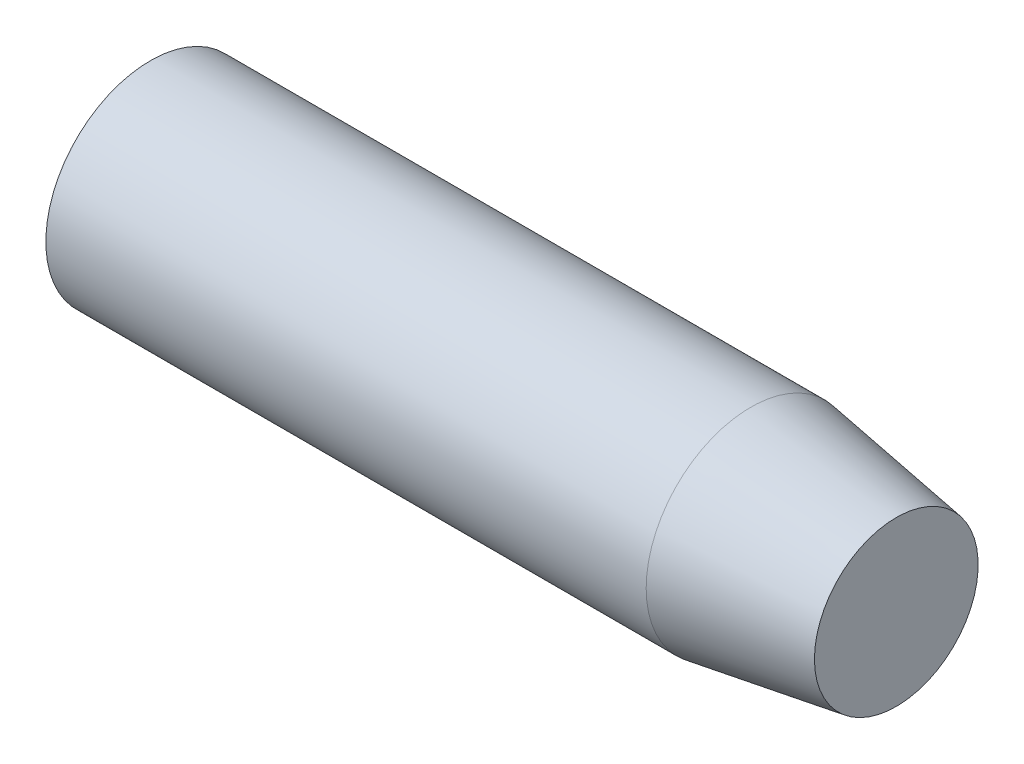
ISO-10303-21;
HEADER;
FILE_DESCRIPTION(('STEP AP214'),'2;1');
FILE_NAME('part.step','',(''),(''),'','','');
FILE_SCHEMA(('AUTOMOTIVE_DESIGN { 1 0 10303 214 1 1 1 1 }'));
ENDSEC;
DATA;
#1=APPLICATION_CONTEXT('core data for automotive mechanical design processes');
#2=APPLICATION_PROTOCOL_DEFINITION('international standard','automotive_design',2000,#1);
#3=PRODUCT_CONTEXT('',#1,'mechanical');
#4=PRODUCT('Part','Part','',(#3));
#5=PRODUCT_RELATED_PRODUCT_CATEGORY('part','',(#4));
#6=PRODUCT_DEFINITION_FORMATION('','',#4);
#7=PRODUCT_DEFINITION_CONTEXT('part definition',#1,'design');
#8=PRODUCT_DEFINITION('design','',#6,#7);
#9=PRODUCT_DEFINITION_SHAPE('','',#8);
#10=(LENGTH_UNIT() NAMED_UNIT(*) SI_UNIT(.MILLI.,.METRE.));
#11=(NAMED_UNIT(*) PLANE_ANGLE_UNIT() SI_UNIT($,.RADIAN.));
#12=(NAMED_UNIT(*) SI_UNIT($,.STERADIAN.) SOLID_ANGLE_UNIT());
#13=UNCERTAINTY_MEASURE_WITH_UNIT(LENGTH_MEASURE(1.E-05),#10,'distance_accuracy_value','');
#14=(GEOMETRIC_REPRESENTATION_CONTEXT(3) GLOBAL_UNCERTAINTY_ASSIGNED_CONTEXT((#13)) GLOBAL_UNIT_ASSIGNED_CONTEXT((#10,
#11,#12)) REPRESENTATION_CONTEXT('',''));
#15=CARTESIAN_POINT('',(0.,0.,0.));
#16=DIRECTION('',(0.,0.,1.));
#17=DIRECTION('',(1.,0.,0.));
#18=AXIS2_PLACEMENT_3D('',#15,#16,#17);
#19=CARTESIAN_POINT('',(130.175,0.,0.));
#20=DIRECTION('',(1.,0.,0.));
#21=DIRECTION('',(0.,0.,-1.));
#22=AXIS2_PLACEMENT_3D('',#19,#20,#21);
#23=PLANE('',#22);
#24=CARTESIAN_POINT('',(130.175,0.,0.));
#25=DIRECTION('',(-1.,0.,0.));
#26=DIRECTION('',(0.,0.,1.));
#27=AXIS2_PLACEMENT_3D('',#24,#25,#26);
#28=CIRCLE('',#27,14.2875000000014);
#29=CARTESIAN_POINT('',(130.175,0.,14.2875000000014));
#30=VERTEX_POINT('',#29);
#31=EDGE_CURVE('E18',#30,#30,#28,.T.);
#32=ORIENTED_EDGE('',*,*,#31,.F.);
#33=EDGE_LOOP('',(#32));
#34=FACE_BOUND('',#33,.T.);
#35=ADVANCED_FACE('F15',(#34),#23,.T.);
#36=CARTESIAN_POINT('',(0.,0.,0.));
#37=DIRECTION('',(1.,0.,0.));
#38=DIRECTION('',(0.,0.,-1.));
#39=AXIS2_PLACEMENT_3D('',#36,#37,#38);
#40=PLANE('',#39);
#41=CARTESIAN_POINT('',(0.,0.,0.));
#42=DIRECTION('',(1.,0.,0.));
#43=DIRECTION('',(0.,0.,-1.));
#44=AXIS2_PLACEMENT_3D('',#41,#42,#43);
#45=CIRCLE('',#44,18.25625);
#46=CARTESIAN_POINT('',(0.,0.,-18.25625));
#47=VERTEX_POINT('',#46);
#48=EDGE_CURVE('E22',#47,#47,#45,.T.);
#49=ORIENTED_EDGE('',*,*,#48,.F.);
#50=EDGE_LOOP('',(#49));
#51=FACE_BOUND('',#50,.T.);
#52=ADVANCED_FACE('F35',(#51),#40,.F.);
#53=CARTESIAN_POINT('',(104.775,0.,0.));
#54=DIRECTION('',(-1.,0.,0.));
#55=DIRECTION('',(0.,0.,1.));
#56=AXIS2_PLACEMENT_3D('',#53,#54,#55);
#57=CONICAL_SURFACE('',#56,18.2562500000005,0.154996741923907);
#58=CARTESIAN_POINT('',(104.775,0.,0.));
#59=DIRECTION('',(1.,0.,0.));
#60=DIRECTION('',(0.,0.,-1.));
#61=AXIS2_PLACEMENT_3D('',#58,#59,#60);
#62=CIRCLE('',#61,18.25625);
#63=CARTESIAN_POINT('',(104.775,0.,-18.25625));
#64=VERTEX_POINT('',#63);
#65=EDGE_CURVE('E10',#64,#64,#62,.F.);
#66=ORIENTED_EDGE('',*,*,#65,.F.);
#67=EDGE_LOOP('',(#66));
#68=FACE_BOUND('',#67,.T.);
#69=ORIENTED_EDGE('',*,*,#31,.T.);
#70=EDGE_LOOP('',(#69));
#71=FACE_BOUND('',#70,.T.);
#72=ADVANCED_FACE('F32',(#68,#71),#57,.T.);
#73=CARTESIAN_POINT('',(0.,0.,0.));
#74=DIRECTION('',(1.,0.,0.));
#75=DIRECTION('',(0.,0.,-1.));
#76=AXIS2_PLACEMENT_3D('',#73,#74,#75);
#77=CYLINDRICAL_SURFACE('',#76,18.25625);
#78=ORIENTED_EDGE('',*,*,#48,.T.);
#79=EDGE_LOOP('',(#78));
#80=FACE_BOUND('',#79,.T.);
#81=ORIENTED_EDGE('',*,*,#65,.T.);
#82=EDGE_LOOP('',(#81));
#83=FACE_BOUND('',#82,.T.);
#84=ADVANCED_FACE('F41',(#80,#83),#77,.T.);
#85=CLOSED_SHELL('',(#35,#52,#72,#84));
#86=MANIFOLD_SOLID_BREP('B1',#85);
#87=ADVANCED_BREP_SHAPE_REPRESENTATION('',(#18,#86),#14);
#88=SHAPE_DEFINITION_REPRESENTATION(#9,#87);
ENDSEC;
END-ISO-10303-21;
